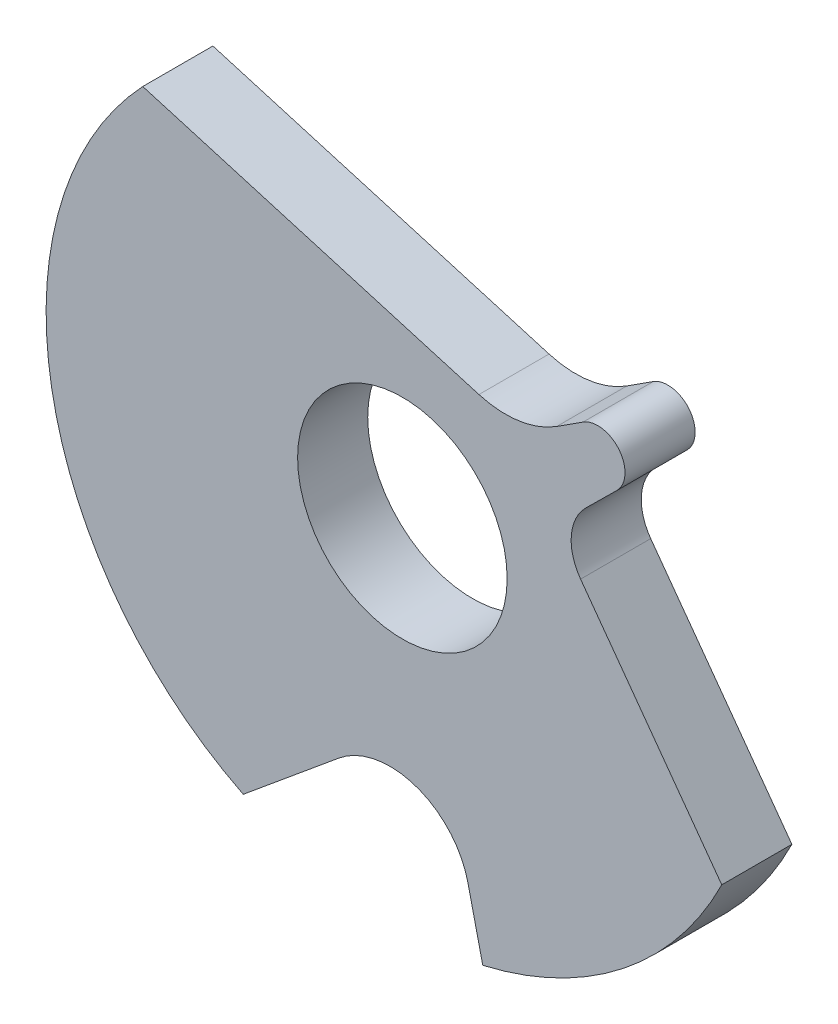
ISO-10303-21;
HEADER;
FILE_DESCRIPTION(('STEP AP214'),'2;1');
FILE_NAME('part.step','',(''),(''),'','','');
FILE_SCHEMA(('AUTOMOTIVE_DESIGN { 1 0 10303 214 1 1 1 1 }'));
ENDSEC;
DATA;
#1=APPLICATION_CONTEXT('core data for automotive mechanical design processes');
#2=APPLICATION_PROTOCOL_DEFINITION('international standard','automotive_design',2000,#1);
#3=PRODUCT_CONTEXT('',#1,'mechanical');
#4=PRODUCT('Part','Part','',(#3));
#5=PRODUCT_RELATED_PRODUCT_CATEGORY('part','',(#4));
#6=PRODUCT_DEFINITION_FORMATION('','',#4);
#7=PRODUCT_DEFINITION_CONTEXT('part definition',#1,'design');
#8=PRODUCT_DEFINITION('design','',#6,#7);
#9=PRODUCT_DEFINITION_SHAPE('','',#8);
#10=(LENGTH_UNIT() NAMED_UNIT(*) SI_UNIT(.MILLI.,.METRE.));
#11=(NAMED_UNIT(*) PLANE_ANGLE_UNIT() SI_UNIT($,.RADIAN.));
#12=(NAMED_UNIT(*) SI_UNIT($,.STERADIAN.) SOLID_ANGLE_UNIT());
#13=UNCERTAINTY_MEASURE_WITH_UNIT(LENGTH_MEASURE(1.E-05),#10,'distance_accuracy_value','');
#14=(GEOMETRIC_REPRESENTATION_CONTEXT(3) GLOBAL_UNCERTAINTY_ASSIGNED_CONTEXT((#13)) GLOBAL_UNIT_ASSIGNED_CONTEXT((#10,
#11,#12)) REPRESENTATION_CONTEXT('',''));
#15=CARTESIAN_POINT('',(0.,0.,0.));
#16=DIRECTION('',(0.,0.,1.));
#17=DIRECTION('',(1.,0.,0.));
#18=AXIS2_PLACEMENT_3D('',#15,#16,#17);
#19=CARTESIAN_POINT('',(-50.0662933785803,-11.3997392483566,14.756));
#20=DIRECTION('',(0.702495462793117,-0.711688221593617,0.));
#21=DIRECTION('',(0.711688221593617,0.702495462793117,0.));
#22=AXIS2_PLACEMENT_3D('',#19,#20,#21);
#23=PLANE('',#22);
#24=DIRECTION('',(0.,0.,1.));
#25=VECTOR('',#24,1.);
#26=CARTESIAN_POINT('',(-49.9581551557131,-11.2929978289922,14.756));
#27=LINE('',#26,#25);
#28=CARTESIAN_POINT('',(-49.958155155713,-11.2929978289921,15.244));
#29=VERTEX_POINT('',#28);
#30=CARTESIAN_POINT('',(-49.9581551557134,-11.2929978289918,14.756));
#31=VERTEX_POINT('',#30);
#32=EDGE_CURVE('E161',#29,#31,#27,.F.);
#33=ORIENTED_EDGE('',*,*,#32,.F.);
#34=DIRECTION('',(0.711688221593239,0.7024954627935,0.));
#35=VECTOR('',#34,1.);
#36=CARTESIAN_POINT('',(-50.174431601445,-11.5064806677211,15.244));
#37=LINE('',#36,#35);
#38=CARTESIAN_POINT('',(-50.1744316014458,-11.5064806677211,15.244));
#39=VERTEX_POINT('',#38);
#40=EDGE_CURVE('E149',#39,#29,#37,.T.);
#41=ORIENTED_EDGE('',*,*,#40,.F.);
#42=DIRECTION('',(0.,0.,1.));
#43=VECTOR('',#42,1.);
#44=CARTESIAN_POINT('',(-50.1744316014457,-11.5064806677204,14.756));
#45=LINE('',#44,#43);
#46=CARTESIAN_POINT('',(-50.174431601446,-11.5064806677207,14.756));
#47=VERTEX_POINT('',#46);
#48=EDGE_CURVE('E198',#39,#47,#45,.F.);
#49=ORIENTED_EDGE('',*,*,#48,.T.);
#50=DIRECTION('',(0.711688221593617,0.702495462793117,0.));
#51=VECTOR('',#50,1.);
#52=CARTESIAN_POINT('',(-50.0662933785803,-11.3997392483566,14.756));
#53=LINE('',#52,#51);
#54=EDGE_CURVE('E157',#47,#31,#53,.T.);
#55=ORIENTED_EDGE('',*,*,#54,.T.);
#56=EDGE_LOOP('',(#33,#41,#49,#55));
#57=FACE_BOUND('',#56,.T.);
#58=ADVANCED_FACE('F36',(#57),#23,.T.);
#59=CARTESIAN_POINT('',(-50.2856262336017,-11.0578119883347,14.756));
#60=DIRECTION('',(-0.541742655040203,0.840544404365404,0.));
#61=DIRECTION('',(-0.840544404365404,-0.541742655040203,0.));
#62=AXIS2_PLACEMENT_3D('',#59,#60,#61);
#63=PLANE('',#62);
#64=DIRECTION('',(0.,0.,1.));
#65=VECTOR('',#64,1.);
#66=CARTESIAN_POINT('',(-50.377244459356,-11.1168612195372,14.756));
#67=LINE('',#66,#65);
#68=CARTESIAN_POINT('',(-50.3772444593558,-11.1168612195376,14.756));
#69=VERTEX_POINT('',#68);
#70=CARTESIAN_POINT('',(-50.3772444593565,-11.1168612195376,15.244));
#71=VERTEX_POINT('',#70);
#72=EDGE_CURVE('E194',#69,#71,#67,.T.);
#73=ORIENTED_EDGE('',*,*,#72,.T.);
#74=DIRECTION('',(-0.840544404366363,-0.541742655038715,0.));
#75=VECTOR('',#74,1.);
#76=CARTESIAN_POINT('',(-50.1940080078498,-10.9987627571322,15.244));
#77=LINE('',#76,#75);
#78=CARTESIAN_POINT('',(-50.1940080078494,-10.9987627571321,15.244));
#79=VERTEX_POINT('',#78);
#80=EDGE_CURVE('E133',#79,#71,#77,.T.);
#81=ORIENTED_EDGE('',*,*,#80,.F.);
#82=DIRECTION('',(0.,0.,1.));
#83=VECTOR('',#82,1.);
#84=CARTESIAN_POINT('',(-50.1940080078496,-10.9987627571324,14.756));
#85=LINE('',#84,#83);
#86=CARTESIAN_POINT('',(-50.1940080078494,-10.9987627571324,14.756));
#87=VERTEX_POINT('',#86);
#88=EDGE_CURVE('E158',#87,#79,#85,.T.);
#89=ORIENTED_EDGE('',*,*,#88,.F.);
#90=DIRECTION('',(-0.840544404365404,-0.541742655040203,0.));
#91=VECTOR('',#90,1.);
#92=CARTESIAN_POINT('',(-50.2856262336017,-11.0578119883347,14.756));
#93=LINE('',#92,#91);
#94=EDGE_CURVE('E152',#87,#69,#93,.T.);
#95=ORIENTED_EDGE('',*,*,#94,.T.);
#96=EDGE_LOOP('',(#73,#81,#89,#95));
#97=FACE_BOUND('',#96,.T.);
#98=ADVANCED_FACE('F236',(#97),#63,.T.);
#99=CARTESIAN_POINT('',(-51.6237466088259,-12.5823954017428,15.244));
#100=DIRECTION('',(0.,0.,1.));
#101=DIRECTION('',(1.,0.,0.));
#102=AXIS2_PLACEMENT_3D('',#99,#100,#101);
#103=PLANE('',#102);
#104=CARTESIAN_POINT('',(-51.4513183691246,-12.2063177663272,15.244));
#105=DIRECTION('',(0.,0.,1.));
#106=DIRECTION('',(1.,0.,0.));
#107=AXIS2_PLACEMENT_3D('',#104,#105,#106);
#108=CIRCLE('',#107,0.72920271368774);
#109=CARTESIAN_POINT('',(-50.7221156554368,-12.2063177663272,15.244));
#110=VERTEX_POINT('',#109);
#111=EDGE_CURVE('E154',#110,#110,#108,.F.);
#112=ORIENTED_EDGE('',*,*,#111,.T.);
#113=EDGE_LOOP('',(#112));
#114=FACE_BOUND('',#113,.T.);
#115=CARTESIAN_POINT('',(-50.7333736884019,-10.5643065555831,15.244));
#116=DIRECTION('',(0.,0.,1.));
#117=DIRECTION('',(1.,0.,0.));
#118=AXIS2_PLACEMENT_3D('',#115,#116,#117);
#119=CIRCLE('',#118,0.657377124973412);
#120=CARTESIAN_POINT('',(-50.9185604126199,-11.1950605184018,15.244));
#121=VERTEX_POINT('',#120);
#122=EDGE_CURVE('E192',#71,#121,#119,.F.);
#123=ORIENTED_EDGE('',*,*,#122,.T.);
#124=DIRECTION('',(-0.959500930070167,0.28170545822629,0.));
#125=VECTOR('',#124,1.);
#126=CARTESIAN_POINT('',(-52.0883161967084,-10.8516251148057,15.244));
#127=LINE('',#126,#125);
#128=CARTESIAN_POINT('',(-53.2580719807968,-10.5081897112096,15.244));
#129=VERTEX_POINT('',#128);
#130=EDGE_CURVE('E127',#129,#121,#127,.F.);
#131=ORIENTED_EDGE('',*,*,#130,.F.);
#132=CARTESIAN_POINT('',(-51.4513183691246,-12.2063177663272,15.244));
#133=DIRECTION('',(0.,0.,1.));
#134=DIRECTION('',(1.,0.,0.));
#135=AXIS2_PLACEMENT_3D('',#132,#133,#134);
#136=CIRCLE('',#135,2.47951557867004);
#137=CARTESIAN_POINT('',(-52.5587329473402,-14.4247925705162,15.244));
#138=VERTEX_POINT('',#137);
#139=EDGE_CURVE('E39',#138,#129,#136,.F.);
#140=ORIENTED_EDGE('',*,*,#139,.F.);
#141=DIRECTION('',(0.770216907515305,0.637782028108005,0.));
#142=VECTOR('',#141,1.);
#143=CARTESIAN_POINT('',(-52.2256548218516,-14.1489855344465,15.244));
#144=LINE('',#143,#142);
#145=CARTESIAN_POINT('',(-51.8925766963611,-13.8731784983754,15.244));
#146=VERTEX_POINT('',#145);
#147=EDGE_CURVE('E125',#146,#138,#144,.F.);
#148=ORIENTED_EDGE('',*,*,#147,.F.);
#149=CARTESIAN_POINT('',(-51.5374506510031,-14.3020461559445,15.244));
#150=DIRECTION('',(0.,0.,1.));
#151=DIRECTION('',(1.,0.,0.));
#152=AXIS2_PLACEMENT_3D('',#149,#150,#151);
#153=CIRCLE('',#152,0.556814130388492);
#154=CARTESIAN_POINT('',(-50.994993488227,-14.176418920226,15.244));
#155=VERTEX_POINT('',#154);
#156=EDGE_CURVE('E201',#146,#155,#153,.F.);
#157=ORIENTED_EDGE('',*,*,#156,.T.);
#158=DIRECTION('',(0.225617901668311,-0.974215870557849,0.));
#159=VECTOR('',#158,1.);
#160=CARTESIAN_POINT('',(-50.9434060752478,-14.3991728598457,15.244));
#161=LINE('',#160,#159);
#162=CARTESIAN_POINT('',(-50.8918186622694,-14.6219267994638,15.244));
#163=VERTEX_POINT('',#162);
#164=EDGE_CURVE('E168',#163,#155,#161,.F.);
#165=ORIENTED_EDGE('',*,*,#164,.F.);
#166=CARTESIAN_POINT('',(-51.4513183691246,-12.2063177663272,15.244));
#167=DIRECTION('',(0.,0.,1.));
#168=DIRECTION('',(1.,0.,0.));
#169=AXIS2_PLACEMENT_3D('',#166,#167,#168);
#170=CIRCLE('',#169,2.47955780794524);
#171=CARTESIAN_POINT('',(-49.2285164227679,-13.3051163967479,15.244));
#172=VERTEX_POINT('',#171);
#173=EDGE_CURVE('E199',#172,#163,#170,.F.);
#174=ORIENTED_EDGE('',*,*,#173,.F.);
#175=DIRECTION('',(-0.588051322836113,0.808823615945218,0.));
#176=VECTOR('',#175,1.);
#177=CARTESIAN_POINT('',(-49.7197689238348,-12.6294328146777,15.244));
#178=LINE('',#177,#176);
#179=CARTESIAN_POINT('',(-50.2110214249007,-11.9537492326088,15.244));
#180=VERTEX_POINT('',#179);
#181=EDGE_CURVE('E163',#180,#172,#178,.F.);
#182=ORIENTED_EDGE('',*,*,#181,.F.);
#183=CARTESIAN_POINT('',(-49.9326876775732,-11.7513880192622,15.244));
#184=DIRECTION('',(0.,0.,1.));
#185=DIRECTION('',(1.,0.,0.));
#186=AXIS2_PLACEMENT_3D('',#183,#184,#185);
#187=CIRCLE('',#186,0.344121687152284);
#188=EDGE_CURVE('E166',#180,#39,#187,.F.);
#189=ORIENTED_EDGE('',*,*,#188,.T.);
#190=ORIENTED_EDGE('',*,*,#40,.T.);
#191=CARTESIAN_POINT('',(-50.0913174147194,-11.1580930270182,15.244));
#192=DIRECTION('',(0.,0.,1.));
#193=DIRECTION('',(1.,0.,0.));
#194=AXIS2_PLACEMENT_3D('',#191,#192,#193);
#195=CIRCLE('',#194,0.189556041368537);
#196=EDGE_CURVE('E160',#79,#29,#195,.F.);
#197=ORIENTED_EDGE('',*,*,#196,.F.);
#198=ORIENTED_EDGE('',*,*,#80,.T.);
#199=EDGE_LOOP('',(#123,#131,#140,#148,#157,#165,#174,#182,#189,#190,#197,#198));
#200=FACE_BOUND('',#199,.T.);
#201=ADVANCED_FACE('F124',(#114,#200),#103,.T.);
#202=CARTESIAN_POINT('',(-51.4513183691246,-12.2063177663272,14.756));
#203=DIRECTION('',(0.,0.,1.));
#204=DIRECTION('',(1.,0.,0.));
#205=AXIS2_PLACEMENT_3D('',#202,#203,#204);
#206=CYLINDRICAL_SURFACE('',#205,2.47951557867004);
#207=DIRECTION('',(0.,0.,1.));
#208=VECTOR('',#207,1.);
#209=CARTESIAN_POINT('',(-52.5587329473399,-14.4247925705159,14.756));
#210=LINE('',#209,#208);
#211=CARTESIAN_POINT('',(-52.5587329473406,-14.424792570516,14.756));
#212=VERTEX_POINT('',#211);
#213=EDGE_CURVE('E132',#138,#212,#210,.F.);
#214=ORIENTED_EDGE('',*,*,#213,.F.);
#215=ORIENTED_EDGE('',*,*,#139,.T.);
#216=DIRECTION('',(0.,0.,1.));
#217=VECTOR('',#216,1.);
#218=CARTESIAN_POINT('',(-53.2580719807969,-10.5081897112095,14.756));
#219=LINE('',#218,#217);
#220=CARTESIAN_POINT('',(-53.2580719807968,-10.5081897112095,14.756));
#221=VERTEX_POINT('',#220);
#222=EDGE_CURVE('E155',#221,#129,#219,.T.);
#223=ORIENTED_EDGE('',*,*,#222,.F.);
#224=CARTESIAN_POINT('',(-51.4513183691246,-12.2063177663272,14.756));
#225=DIRECTION('',(0.,0.,1.));
#226=DIRECTION('',(1.,0.,0.));
#227=AXIS2_PLACEMENT_3D('',#224,#225,#226);
#228=CIRCLE('',#227,2.47951557867004);
#229=EDGE_CURVE('E143',#221,#212,#228,.T.);
#230=ORIENTED_EDGE('',*,*,#229,.T.);
#231=EDGE_LOOP('',(#214,#215,#223,#230));
#232=FACE_BOUND('',#231,.T.);
#233=ADVANCED_FACE('F142',(#232),#206,.T.);
#234=CARTESIAN_POINT('',(-52.2256548218516,-14.1489855344465,14.756));
#235=DIRECTION('',(0.637782028108005,-0.770216907515305,0.));
#236=DIRECTION('',(0.770216907515305,0.637782028108005,0.));
#237=AXIS2_PLACEMENT_3D('',#234,#235,#236);
#238=PLANE('',#237);
#239=DIRECTION('',(0.,0.,1.));
#240=VECTOR('',#239,1.);
#241=CARTESIAN_POINT('',(-51.8925766963606,-13.8731784983751,14.756));
#242=LINE('',#241,#240);
#243=CARTESIAN_POINT('',(-51.8925766963607,-13.8731784983753,14.756));
#244=VERTEX_POINT('',#243);
#245=EDGE_CURVE('E139',#244,#146,#242,.T.);
#246=ORIENTED_EDGE('',*,*,#245,.T.);
#247=ORIENTED_EDGE('',*,*,#147,.T.);
#248=ORIENTED_EDGE('',*,*,#213,.T.);
#249=DIRECTION('',(0.770216907516188,0.637782028106939,0.));
#250=VECTOR('',#249,1.);
#251=CARTESIAN_POINT('',(-52.5587329473404,-14.4247925705153,14.756));
#252=LINE('',#251,#250);
#253=EDGE_CURVE('E188',#212,#244,#252,.T.);
#254=ORIENTED_EDGE('',*,*,#253,.T.);
#255=EDGE_LOOP('',(#246,#247,#248,#254));
#256=FACE_BOUND('',#255,.T.);
#257=ADVANCED_FACE('F136',(#256),#238,.T.);
#258=CARTESIAN_POINT('',(-51.5374506510031,-14.3020461559445,14.756));
#259=DIRECTION('',(0.,0.,1.));
#260=DIRECTION('',(1.,0.,0.));
#261=AXIS2_PLACEMENT_3D('',#258,#259,#260);
#262=CYLINDRICAL_SURFACE('',#261,0.556814130388492);
#263=ORIENTED_EDGE('',*,*,#245,.F.);
#264=CARTESIAN_POINT('',(-51.5374506510031,-14.3020461559445,14.756));
#265=DIRECTION('',(0.,0.,1.));
#266=DIRECTION('',(1.,0.,0.));
#267=AXIS2_PLACEMENT_3D('',#264,#265,#266);
#268=CIRCLE('',#267,0.556814130388492);
#269=CARTESIAN_POINT('',(-50.9949934882275,-14.176418920226,14.756));
#270=VERTEX_POINT('',#269);
#271=EDGE_CURVE('E186',#244,#270,#268,.F.);
#272=ORIENTED_EDGE('',*,*,#271,.T.);
#273=DIRECTION('',(0.,0.,1.));
#274=VECTOR('',#273,1.);
#275=CARTESIAN_POINT('',(-50.9949934882272,-14.1764189202252,14.756));
#276=LINE('',#275,#274);
#277=EDGE_CURVE('E171',#155,#270,#276,.F.);
#278=ORIENTED_EDGE('',*,*,#277,.F.);
#279=ORIENTED_EDGE('',*,*,#156,.F.);
#280=EDGE_LOOP('',(#263,#272,#278,#279));
#281=FACE_BOUND('',#280,.T.);
#282=ADVANCED_FACE('F260',(#281),#262,.F.);
#283=CARTESIAN_POINT('',(-50.9434060752478,-14.3991728598457,14.756));
#284=DIRECTION('',(-0.974215870557849,-0.225617901668311,0.));
#285=DIRECTION('',(0.225617901668311,-0.974215870557849,0.));
#286=AXIS2_PLACEMENT_3D('',#283,#284,#285);
#287=PLANE('',#286);
#288=DIRECTION('',(0.,0.,1.));
#289=VECTOR('',#288,1.);
#290=CARTESIAN_POINT('',(-50.8918186622698,-14.6219267994639,14.756));
#291=LINE('',#290,#289);
#292=CARTESIAN_POINT('',(-50.8918186622698,-14.6219267994639,14.756));
#293=VERTEX_POINT('',#292);
#294=EDGE_CURVE('E170',#163,#293,#291,.F.);
#295=ORIENTED_EDGE('',*,*,#294,.F.);
#296=ORIENTED_EDGE('',*,*,#164,.T.);
#297=ORIENTED_EDGE('',*,*,#277,.T.);
#298=DIRECTION('',(0.225617901668807,-0.974215870557734,0.));
#299=VECTOR('',#298,1.);
#300=CARTESIAN_POINT('',(-50.9949934882282,-14.1764189202255,14.756));
#301=LINE('',#300,#299);
#302=EDGE_CURVE('E185',#270,#293,#301,.T.);
#303=ORIENTED_EDGE('',*,*,#302,.T.);
#304=EDGE_LOOP('',(#295,#296,#297,#303));
#305=FACE_BOUND('',#304,.T.);
#306=ADVANCED_FACE('F258',(#305),#287,.T.);
#307=CARTESIAN_POINT('',(-51.4513183691246,-12.2063177663272,14.756));
#308=DIRECTION('',(0.,0.,1.));
#309=DIRECTION('',(1.,0.,0.));
#310=AXIS2_PLACEMENT_3D('',#307,#308,#309);
#311=CYLINDRICAL_SURFACE('',#310,2.47955780794524);
#312=DIRECTION('',(0.,0.,1.));
#313=VECTOR('',#312,1.);
#314=CARTESIAN_POINT('',(-49.2285164227681,-13.3051163967477,14.756));
#315=LINE('',#314,#313);
#316=CARTESIAN_POINT('',(-49.2285164227675,-13.3051163967471,14.756));
#317=VERTEX_POINT('',#316);
#318=EDGE_CURVE('E167',#172,#317,#315,.F.);
#319=ORIENTED_EDGE('',*,*,#318,.F.);
#320=ORIENTED_EDGE('',*,*,#173,.T.);
#321=ORIENTED_EDGE('',*,*,#294,.T.);
#322=CARTESIAN_POINT('',(-51.4513183691246,-12.2063177663272,14.756));
#323=DIRECTION('',(0.,0.,1.));
#324=DIRECTION('',(1.,0.,0.));
#325=AXIS2_PLACEMENT_3D('',#322,#323,#324);
#326=CIRCLE('',#325,2.47955780794524);
#327=EDGE_CURVE('E182',#293,#317,#326,.T.);
#328=ORIENTED_EDGE('',*,*,#327,.T.);
#329=EDGE_LOOP('',(#319,#320,#321,#328));
#330=FACE_BOUND('',#329,.T.);
#331=ADVANCED_FACE('F255',(#330),#311,.T.);
#332=CARTESIAN_POINT('',(-49.7197689238348,-12.6294328146777,14.756));
#333=DIRECTION('',(0.808823615945218,0.588051322836113,0.));
#334=DIRECTION('',(-0.588051322836113,0.808823615945218,0.));
#335=AXIS2_PLACEMENT_3D('',#332,#333,#334);
#336=PLANE('',#335);
#337=DIRECTION('',(0.,0.,1.));
#338=VECTOR('',#337,1.);
#339=CARTESIAN_POINT('',(-50.2110214249007,-11.953749232609,14.756));
#340=LINE('',#339,#338);
#341=CARTESIAN_POINT('',(-50.2110214249005,-11.9537492326089,14.756));
#342=VERTEX_POINT('',#341);
#343=EDGE_CURVE('E210',#342,#180,#340,.T.);
#344=ORIENTED_EDGE('',*,*,#343,.T.);
#345=ORIENTED_EDGE('',*,*,#181,.T.);
#346=ORIENTED_EDGE('',*,*,#318,.T.);
#347=DIRECTION('',(-0.588051322836771,0.80882361594474,0.));
#348=VECTOR('',#347,1.);
#349=CARTESIAN_POINT('',(-49.2285164227668,-13.3051163967468,14.756));
#350=LINE('',#349,#348);
#351=EDGE_CURVE('E181',#317,#342,#350,.T.);
#352=ORIENTED_EDGE('',*,*,#351,.T.);
#353=EDGE_LOOP('',(#344,#345,#346,#352));
#354=FACE_BOUND('',#353,.T.);
#355=ADVANCED_FACE('F251',(#354),#336,.T.);
#356=CARTESIAN_POINT('',(-49.9326876775732,-11.7513880192622,14.756));
#357=DIRECTION('',(0.,0.,1.));
#358=DIRECTION('',(1.,0.,0.));
#359=AXIS2_PLACEMENT_3D('',#356,#357,#358);
#360=CYLINDRICAL_SURFACE('',#359,0.344121687152284);
#361=CARTESIAN_POINT('',(-49.9326876775732,-11.7513880192622,14.756));
#362=DIRECTION('',(0.,0.,1.));
#363=DIRECTION('',(1.,0.,0.));
#364=AXIS2_PLACEMENT_3D('',#361,#362,#363);
#365=CIRCLE('',#364,0.344121687152284);
#366=EDGE_CURVE('E178',#342,#47,#365,.F.);
#367=ORIENTED_EDGE('',*,*,#366,.T.);
#368=ORIENTED_EDGE('',*,*,#48,.F.);
#369=ORIENTED_EDGE('',*,*,#188,.F.);
#370=ORIENTED_EDGE('',*,*,#343,.F.);
#371=EDGE_LOOP('',(#367,#368,#369,#370));
#372=FACE_BOUND('',#371,.T.);
#373=ADVANCED_FACE('F247',(#372),#360,.F.);
#374=CARTESIAN_POINT('',(-50.0913174147194,-11.1580930270182,14.756));
#375=DIRECTION('',(0.,0.,1.));
#376=DIRECTION('',(1.,0.,0.));
#377=AXIS2_PLACEMENT_3D('',#374,#375,#376);
#378=CYLINDRICAL_SURFACE('',#377,0.189556041368537);
#379=ORIENTED_EDGE('',*,*,#88,.T.);
#380=ORIENTED_EDGE('',*,*,#196,.T.);
#381=ORIENTED_EDGE('',*,*,#32,.T.);
#382=CARTESIAN_POINT('',(-50.0913174147194,-11.1580930270182,14.756));
#383=DIRECTION('',(0.,0.,1.));
#384=DIRECTION('',(1.,0.,0.));
#385=AXIS2_PLACEMENT_3D('',#382,#383,#384);
#386=CIRCLE('',#385,0.189556041368537);
#387=EDGE_CURVE('E176',#31,#87,#386,.T.);
#388=ORIENTED_EDGE('',*,*,#387,.T.);
#389=EDGE_LOOP('',(#379,#380,#381,#388));
#390=FACE_BOUND('',#389,.T.);
#391=ADVANCED_FACE('F242',(#390),#378,.T.);
#392=CARTESIAN_POINT('',(-50.7333736884019,-10.5643065555831,14.756));
#393=DIRECTION('',(0.,0.,1.));
#394=DIRECTION('',(1.,0.,0.));
#395=AXIS2_PLACEMENT_3D('',#392,#393,#394);
#396=CYLINDRICAL_SURFACE('',#395,0.657377124973412);
#397=CARTESIAN_POINT('',(-50.7333736884019,-10.5643065555831,14.756));
#398=DIRECTION('',(0.,0.,1.));
#399=DIRECTION('',(1.,0.,0.));
#400=AXIS2_PLACEMENT_3D('',#397,#398,#399);
#401=CIRCLE('',#400,0.657377124973412);
#402=CARTESIAN_POINT('',(-50.9185604126199,-11.1950605184018,14.756));
#403=VERTEX_POINT('',#402);
#404=EDGE_CURVE('E173',#69,#403,#401,.F.);
#405=ORIENTED_EDGE('',*,*,#404,.T.);
#406=DIRECTION('',(0.,0.,1.));
#407=VECTOR('',#406,1.);
#408=CARTESIAN_POINT('',(-50.9185604126199,-11.1950605184018,14.756));
#409=LINE('',#408,#407);
#410=EDGE_CURVE('E54',#121,#403,#409,.F.);
#411=ORIENTED_EDGE('',*,*,#410,.F.);
#412=ORIENTED_EDGE('',*,*,#122,.F.);
#413=ORIENTED_EDGE('',*,*,#72,.F.);
#414=EDGE_LOOP('',(#405,#411,#412,#413));
#415=FACE_BOUND('',#414,.T.);
#416=ADVANCED_FACE('F232',(#415),#396,.F.);
#417=CARTESIAN_POINT('',(-52.0883161967084,-10.8516251148057,14.756));
#418=DIRECTION('',(0.28170545822629,0.959500930070167,0.));
#419=DIRECTION('',(-0.959500930070167,0.28170545822629,0.));
#420=AXIS2_PLACEMENT_3D('',#417,#418,#419);
#421=PLANE('',#420);
#422=ORIENTED_EDGE('',*,*,#222,.T.);
#423=ORIENTED_EDGE('',*,*,#130,.T.);
#424=ORIENTED_EDGE('',*,*,#410,.T.);
#425=DIRECTION('',(-0.959500930070155,0.281705458226331,0.));
#426=VECTOR('',#425,1.);
#427=CARTESIAN_POINT('',(-50.9185604126199,-11.1950605184018,14.756));
#428=LINE('',#427,#426);
#429=EDGE_CURVE('E45',#403,#221,#428,.T.);
#430=ORIENTED_EDGE('',*,*,#429,.T.);
#431=EDGE_LOOP('',(#422,#423,#424,#430));
#432=FACE_BOUND('',#431,.T.);
#433=ADVANCED_FACE('F225',(#432),#421,.T.);
#434=CARTESIAN_POINT('',(-51.4513183691246,-12.2063177663272,14.756));
#435=DIRECTION('',(0.,0.,1.));
#436=DIRECTION('',(1.,0.,0.));
#437=AXIS2_PLACEMENT_3D('',#434,#435,#436);
#438=CYLINDRICAL_SURFACE('',#437,0.72920271368774);
#439=CARTESIAN_POINT('',(-51.4513183691246,-12.2063177663272,14.756));
#440=DIRECTION('',(0.,0.,1.));
#441=DIRECTION('',(1.,0.,0.));
#442=AXIS2_PLACEMENT_3D('',#439,#440,#441);
#443=CIRCLE('',#442,0.72920271368774);
#444=CARTESIAN_POINT('',(-50.7221156554368,-12.2063177663272,14.756));
#445=VERTEX_POINT('',#444);
#446=EDGE_CURVE('E11',#445,#445,#443,.F.);
#447=ORIENTED_EDGE('',*,*,#446,.T.);
#448=EDGE_LOOP('',(#447));
#449=FACE_BOUND('',#448,.T.);
#450=ORIENTED_EDGE('',*,*,#111,.F.);
#451=EDGE_LOOP('',(#450));
#452=FACE_BOUND('',#451,.T.);
#453=ADVANCED_FACE('F270',(#449,#452),#438,.F.);
#454=CARTESIAN_POINT('',(-51.6237466088259,-12.5823954017428,14.756));
#455=DIRECTION('',(0.,0.,1.));
#456=DIRECTION('',(1.,0.,0.));
#457=AXIS2_PLACEMENT_3D('',#454,#455,#456);
#458=PLANE('',#457);
#459=ORIENTED_EDGE('',*,*,#446,.F.);
#460=EDGE_LOOP('',(#459));
#461=FACE_BOUND('',#460,.T.);
#462=ORIENTED_EDGE('',*,*,#404,.F.);
#463=ORIENTED_EDGE('',*,*,#94,.F.);
#464=ORIENTED_EDGE('',*,*,#387,.F.);
#465=ORIENTED_EDGE('',*,*,#54,.F.);
#466=ORIENTED_EDGE('',*,*,#366,.F.);
#467=ORIENTED_EDGE('',*,*,#351,.F.);
#468=ORIENTED_EDGE('',*,*,#327,.F.);
#469=ORIENTED_EDGE('',*,*,#302,.F.);
#470=ORIENTED_EDGE('',*,*,#271,.F.);
#471=ORIENTED_EDGE('',*,*,#253,.F.);
#472=ORIENTED_EDGE('',*,*,#229,.F.);
#473=ORIENTED_EDGE('',*,*,#429,.F.);
#474=EDGE_LOOP('',(#462,#463,#464,#465,#466,#467,#468,#469,#470,#471,#472,#473));
#475=FACE_BOUND('',#474,.T.);
#476=ADVANCED_FACE('F228',(#461,#475),#458,.F.);
#477=CLOSED_SHELL('',(#58,#98,#201,#233,#257,#282,#306,#331,#355,#373,#391,#416,#433,#453,#476));
#478=MANIFOLD_SOLID_BREP('B2',#477);
#479=ADVANCED_BREP_SHAPE_REPRESENTATION('',(#18,#478),#14);
#480=SHAPE_DEFINITION_REPRESENTATION(#9,#479);
ENDSEC;
END-ISO-10303-21;
